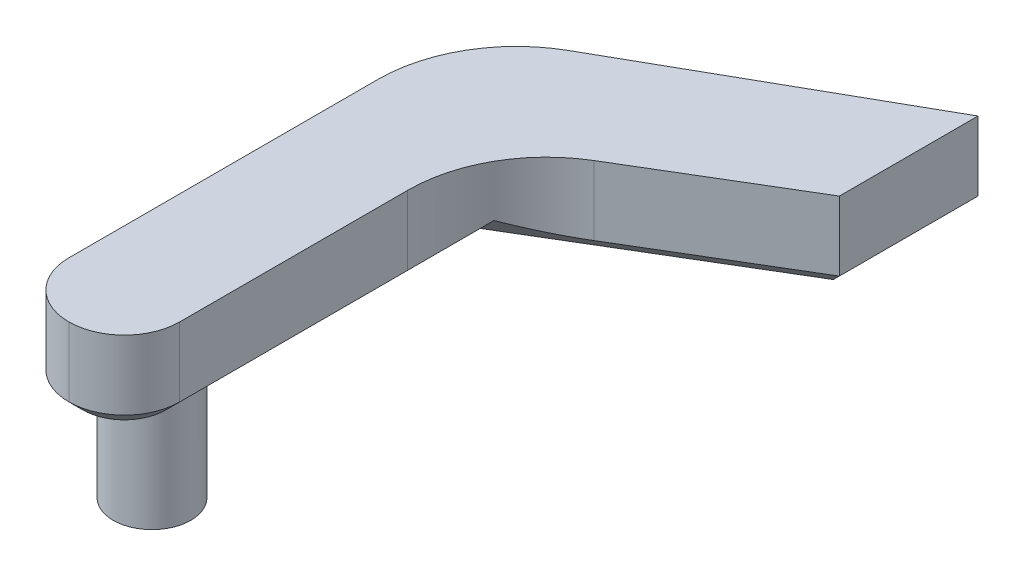
ISO-10303-21;
HEADER;
FILE_DESCRIPTION(('STEP AP214'),'2;1');
FILE_NAME('part.step','',(''),(''),'','','');
FILE_SCHEMA(('AUTOMOTIVE_DESIGN { 1 0 10303 214 1 1 1 1 }'));
ENDSEC;
DATA;
#1=APPLICATION_CONTEXT('core data for automotive mechanical design processes');
#2=APPLICATION_PROTOCOL_DEFINITION('international standard','automotive_design',2000,#1);
#3=PRODUCT_CONTEXT('',#1,'mechanical');
#4=PRODUCT('Part','Part','',(#3));
#5=PRODUCT_RELATED_PRODUCT_CATEGORY('part','',(#4));
#6=PRODUCT_DEFINITION_FORMATION('','',#4);
#7=PRODUCT_DEFINITION_CONTEXT('part definition',#1,'design');
#8=PRODUCT_DEFINITION('design','',#6,#7);
#9=PRODUCT_DEFINITION_SHAPE('','',#8);
#10=(LENGTH_UNIT() NAMED_UNIT(*) SI_UNIT(.MILLI.,.METRE.));
#11=(NAMED_UNIT(*) PLANE_ANGLE_UNIT() SI_UNIT($,.RADIAN.));
#12=(NAMED_UNIT(*) SI_UNIT($,.STERADIAN.) SOLID_ANGLE_UNIT());
#13=UNCERTAINTY_MEASURE_WITH_UNIT(LENGTH_MEASURE(1.E-05),#10,'distance_accuracy_value','');
#14=(GEOMETRIC_REPRESENTATION_CONTEXT(3) GLOBAL_UNCERTAINTY_ASSIGNED_CONTEXT((#13)) GLOBAL_UNIT_ASSIGNED_CONTEXT((#10,
#11,#12)) REPRESENTATION_CONTEXT('',''));
#15=CARTESIAN_POINT('',(0.,0.,0.));
#16=DIRECTION('',(0.,0.,1.));
#17=DIRECTION('',(1.,0.,0.));
#18=AXIS2_PLACEMENT_3D('',#15,#16,#17);
#19=CARTESIAN_POINT('',(-12.,-2.,-9.));
#20=DIRECTION('',(0.,1.,0.));
#21=DIRECTION('',(0.,0.,1.));
#22=AXIS2_PLACEMENT_3D('',#19,#20,#21);
#23=CYLINDRICAL_SURFACE('',#22,2.8);
#24=CARTESIAN_POINT('',(-12.,-2.,-9.));
#25=DIRECTION('',(0.,-1.,0.));
#26=DIRECTION('',(0.,0.,-1.));
#27=AXIS2_PLACEMENT_3D('',#24,#25,#26);
#28=CIRCLE('',#27,2.8);
#29=CARTESIAN_POINT('',(-12.,-2.,-11.8));
#30=VERTEX_POINT('',#29);
#31=EDGE_CURVE('E158',#30,#30,#28,.T.);
#32=ORIENTED_EDGE('',*,*,#31,.F.);
#33=EDGE_LOOP('',(#32));
#34=FACE_BOUND('',#33,.T.);
#35=CARTESIAN_POINT('',(-12.,6.,-9.));
#36=DIRECTION('',(0.,1.,0.));
#37=DIRECTION('',(0.,0.,1.));
#38=AXIS2_PLACEMENT_3D('',#35,#36,#37);
#39=CIRCLE('',#38,2.8);
#40=CARTESIAN_POINT('',(-12.,6.,-6.2));
#41=VERTEX_POINT('',#40);
#42=EDGE_CURVE('E168',#41,#41,#39,.F.);
#43=ORIENTED_EDGE('',*,*,#42,.T.);
#44=EDGE_LOOP('',(#43));
#45=FACE_BOUND('',#44,.T.);
#46=ADVANCED_FACE('F35',(#34,#45),#23,.T.);
#47=CARTESIAN_POINT('',(-12.,-2.,-9.));
#48=DIRECTION('',(0.,-1.,0.));
#49=DIRECTION('',(0.,0.,-1.));
#50=AXIS2_PLACEMENT_3D('',#47,#48,#49);
#51=PLANE('',#50);
#52=ORIENTED_EDGE('',*,*,#31,.T.);
#53=EDGE_LOOP('',(#52));
#54=FACE_BOUND('',#53,.T.);
#55=ADVANCED_FACE('F305',(#54),#51,.T.);
#56=CARTESIAN_POINT('',(7.92980805409412,63.5412283685863,-38.6493429113385));
#57=DIRECTION('',(-1.,0.,0.));
#58=DIRECTION('',(0.,0.,1.));
#59=AXIS2_PLACEMENT_3D('',#56,#57,#58);
#60=PLANE('',#59);
#61=DIRECTION('',(0.,-1.,0.));
#62=VECTOR('',#61,1.);
#63=CARTESIAN_POINT('',(7.92980805409412,63.5412283685863,-38.6493429113385));
#64=LINE('',#63,#62);
#65=CARTESIAN_POINT('',(7.92980805409412,12.,-38.6493429113385));
#66=VERTEX_POINT('',#65);
#67=CARTESIAN_POINT('',(7.92980805409412,7.00000000000001,-38.6493429113385));
#68=VERTEX_POINT('',#67);
#69=EDGE_CURVE('E157',#66,#68,#64,.T.);
#70=ORIENTED_EDGE('',*,*,#69,.T.);
#71=DIRECTION('',(0.,0.,-1.));
#72=VECTOR('',#71,1.);
#73=CARTESIAN_POINT('',(7.92980805409412,6.99999999999999,-38.6493429113385));
#74=LINE('',#73,#72);
#75=CARTESIAN_POINT('',(7.92980805409412,7.00000000000001,-48.6493429113385));
#76=VERTEX_POINT('',#75);
#77=EDGE_CURVE('E156',#68,#76,#74,.T.);
#78=ORIENTED_EDGE('',*,*,#77,.T.);
#79=DIRECTION('',(0.,-1.,0.));
#80=VECTOR('',#79,1.);
#81=CARTESIAN_POINT('',(7.92980805409412,63.5412283685863,-48.6493429113385));
#82=LINE('',#81,#80);
#83=CARTESIAN_POINT('',(7.92980805409412,12.,-48.6493429113385));
#84=VERTEX_POINT('',#83);
#85=EDGE_CURVE('E137',#84,#76,#82,.T.);
#86=ORIENTED_EDGE('',*,*,#85,.F.);
#87=DIRECTION('',(0.,0.,1.));
#88=VECTOR('',#87,1.);
#89=CARTESIAN_POINT('',(7.92980805409412,12.,-38.6493429113385));
#90=LINE('',#89,#88);
#91=EDGE_CURVE('E142',#84,#66,#90,.T.);
#92=ORIENTED_EDGE('',*,*,#91,.T.);
#93=EDGE_LOOP('',(#70,#78,#86,#92));
#94=FACE_BOUND('',#93,.T.);
#95=ADVANCED_FACE('F154',(#94),#60,.F.);
#96=CARTESIAN_POINT('',(-8.,63.5412283685863,-29.1078969431635));
#97=DIRECTION('',(-0.51384465280707,0.,-0.857883251253678));
#98=DIRECTION('',(-0.857883251253678,0.,0.51384465280707));
#99=AXIS2_PLACEMENT_3D('',#96,#97,#98);
#100=PLANE('',#99);
#101=DIRECTION('',(-0.857883251253678,0.,0.51384465280707));
#102=VECTOR('',#101,1.);
#103=CARTESIAN_POINT('',(-8.,12.,-29.1078969431635));
#104=LINE('',#103,#102);
#105=CARTESIAN_POINT('',(-3.1384465280707,12.,-32.0198121160451));
#106=VERTEX_POINT('',#105);
#107=EDGE_CURVE('E148',#66,#106,#104,.T.);
#108=ORIENTED_EDGE('',*,*,#107,.T.);
#109=DIRECTION('',(0.,-1.,0.));
#110=VECTOR('',#109,1.);
#111=CARTESIAN_POINT('',(-3.1384465280707,7.00000000000001,-32.0198121160451));
#112=LINE('',#111,#110);
#113=CARTESIAN_POINT('',(-3.1384465280707,6.99999999999999,-32.0198121160451));
#114=VERTEX_POINT('',#113);
#115=EDGE_CURVE('E238',#106,#114,#112,.T.);
#116=ORIENTED_EDGE('',*,*,#115,.T.);
#117=DIRECTION('',(0.857883251253678,0.,-0.51384465280707));
#118=VECTOR('',#117,1.);
#119=CARTESIAN_POINT('',(-8.,6.99999999999999,-29.1078969431635));
#120=LINE('',#119,#118);
#121=EDGE_CURVE('E201',#114,#68,#120,.T.);
#122=ORIENTED_EDGE('',*,*,#121,.T.);
#123=ORIENTED_EDGE('',*,*,#69,.F.);
#124=EDGE_LOOP('',(#108,#116,#122,#123));
#125=FACE_BOUND('',#124,.T.);
#126=ADVANCED_FACE('F322',(#125),#100,.F.);
#127=CARTESIAN_POINT('',(7.92980805409412,63.5412283685863,-48.6493429113385));
#128=DIRECTION('',(0.492495520100087,0.,0.8703149790055));
#129=DIRECTION('',(0.8703149790055,0.,-0.492495520100087));
#130=AXIS2_PLACEMENT_3D('',#127,#128,#129);
#131=PLANE('',#130);
#132=DIRECTION('',(-0.8703149790055,0.,0.492495520100087));
#133=VECTOR('',#132,1.);
#134=CARTESIAN_POINT('',(7.92980805409412,6.99999999999999,-48.6493429113385));
#135=LINE('',#134,#133);
#136=CARTESIAN_POINT('',(-10.9249552010009,6.99999999999999,-37.9797730892806));
#137=VERTEX_POINT('',#136);
#138=EDGE_CURVE('E203',#76,#137,#135,.T.);
#139=ORIENTED_EDGE('',*,*,#138,.T.);
#140=DIRECTION('',(0.,-1.,0.));
#141=VECTOR('',#140,1.);
#142=CARTESIAN_POINT('',(-10.9249552010009,63.5412283685863,-37.9797730892806));
#143=LINE('',#142,#141);
#144=CARTESIAN_POINT('',(-10.9249552010009,12.,-37.9797730892806));
#145=VERTEX_POINT('',#144);
#146=EDGE_CURVE('E139',#137,#145,#143,.F.);
#147=ORIENTED_EDGE('',*,*,#146,.T.);
#148=DIRECTION('',(0.8703149790055,0.,-0.492495520100087));
#149=VECTOR('',#148,1.);
#150=CARTESIAN_POINT('',(7.92980805409412,12.,-48.6493429113385));
#151=LINE('',#150,#149);
#152=EDGE_CURVE('E132',#145,#84,#151,.T.);
#153=ORIENTED_EDGE('',*,*,#152,.T.);
#154=ORIENTED_EDGE('',*,*,#85,.T.);
#155=EDGE_LOOP('',(#139,#147,#153,#154));
#156=FACE_BOUND('',#155,.T.);
#157=ADVANCED_FACE('F135',(#156),#131,.F.);
#158=CARTESIAN_POINT('',(0.,12.,0.));
#159=DIRECTION('',(0.,-1.,0.));
#160=DIRECTION('',(0.,0.,-1.));
#161=AXIS2_PLACEMENT_3D('',#158,#159,#160);
#162=PLANE('',#161);
#163=ORIENTED_EDGE('',*,*,#152,.F.);
#164=CARTESIAN_POINT('',(-6.00000000000001,12.,-29.2766232992256));
#165=DIRECTION('',(0.,-1.,0.));
#166=DIRECTION('',(0.,0.,-1.));
#167=AXIS2_PLACEMENT_3D('',#164,#165,#166);
#168=CIRCLE('',#167,10.);
#169=CARTESIAN_POINT('',(-16.,12.,-29.2766232992256));
#170=VERTEX_POINT('',#169);
#171=EDGE_CURVE('E236',#145,#170,#168,.F.);
#172=ORIENTED_EDGE('',*,*,#171,.T.);
#173=DIRECTION('',(0.,0.,-1.));
#174=VECTOR('',#173,1.);
#175=CARTESIAN_POINT('',(-16.,12.,-3.));
#176=LINE('',#175,#174);
#177=CARTESIAN_POINT('',(-16.,12.,-6.99999999999999));
#178=VERTEX_POINT('',#177);
#179=EDGE_CURVE('E143',#178,#170,#176,.T.);
#180=ORIENTED_EDGE('',*,*,#179,.F.);
#181=CARTESIAN_POINT('',(-12.,12.,-6.99999999999999));
#182=DIRECTION('',(0.,-1.,0.));
#183=DIRECTION('',(0.,0.,-1.));
#184=AXIS2_PLACEMENT_3D('',#181,#182,#183);
#185=CIRCLE('',#184,4.);
#186=CARTESIAN_POINT('',(-12.,12.,-3.));
#187=VERTEX_POINT('',#186);
#188=EDGE_CURVE('E174',#178,#187,#185,.F.);
#189=ORIENTED_EDGE('',*,*,#188,.T.);
#190=CARTESIAN_POINT('',(-12.,12.,-7.));
#191=DIRECTION('',(0.,-1.,0.));
#192=DIRECTION('',(0.,0.,-1.));
#193=AXIS2_PLACEMENT_3D('',#190,#191,#192);
#194=CIRCLE('',#193,4.);
#195=CARTESIAN_POINT('',(-8.,12.,-7.));
#196=VERTEX_POINT('',#195);
#197=EDGE_CURVE('E176',#187,#196,#194,.F.);
#198=ORIENTED_EDGE('',*,*,#197,.T.);
#199=DIRECTION('',(0.,0.,1.));
#200=VECTOR('',#199,1.);
#201=CARTESIAN_POINT('',(-8.,12.,-3.));
#202=LINE('',#201,#200);
#203=CARTESIAN_POINT('',(-8.,12.,-23.4409796035083));
#204=VERTEX_POINT('',#203);
#205=EDGE_CURVE('E165',#204,#196,#202,.T.);
#206=ORIENTED_EDGE('',*,*,#205,.F.);
#207=CARTESIAN_POINT('',(2.,12.,-23.4409796035083));
#208=DIRECTION('',(0.,-1.,0.));
#209=DIRECTION('',(0.,0.,-1.));
#210=AXIS2_PLACEMENT_3D('',#207,#208,#209);
#211=CIRCLE('',#210,10.);
#212=EDGE_CURVE('E11',#204,#106,#211,.T.);
#213=ORIENTED_EDGE('',*,*,#212,.T.);
#214=ORIENTED_EDGE('',*,*,#107,.F.);
#215=ORIENTED_EDGE('',*,*,#91,.F.);
#216=EDGE_LOOP('',(#163,#172,#180,#189,#198,#206,#213,#214,#215));
#217=FACE_BOUND('',#216,.T.);
#218=ADVANCED_FACE('F146',(#217),#162,.F.);
#219=CARTESIAN_POINT('',(0.,6.,0.));
#220=DIRECTION('',(0.,1.,0.));
#221=DIRECTION('',(0.,0.,1.));
#222=AXIS2_PLACEMENT_3D('',#219,#220,#221);
#223=PLANE('',#222);
#224=DIRECTION('',(0.,0.,-1.));
#225=VECTOR('',#224,1.);
#226=CARTESIAN_POINT('',(-15.,6.,0.));
#227=LINE('',#226,#225);
#228=CARTESIAN_POINT('',(-15.,6.,-6.99999999999999));
#229=VERTEX_POINT('',#228);
#230=CARTESIAN_POINT('',(-15.,6.,-33.6355222427663));
#231=VERTEX_POINT('',#230);
#232=EDGE_CURVE('E191',#229,#231,#227,.T.);
#233=ORIENTED_EDGE('',*,*,#232,.T.);
#234=CARTESIAN_POINT('',(-6.00000000000001,6.,-29.2766232992256));
#235=DIRECTION('',(0.,1.,0.));
#236=DIRECTION('',(0.,0.,1.));
#237=AXIS2_PLACEMENT_3D('',#234,#235,#236);
#238=CIRCLE('',#237,10.);
#239=CARTESIAN_POINT('',(-14.2260747234355,6.,-34.9627199080124));
#240=VERTEX_POINT('',#239);
#241=EDGE_CURVE('E231',#231,#240,#238,.F.);
#242=ORIENTED_EDGE('',*,*,#241,.T.);
#243=DIRECTION('',(0.870314979005501,0.,-0.492495520100087));
#244=VECTOR('',#243,1.);
#245=CARTESIAN_POINT('',(-18.4364993250522,6.,-32.5801167079791));
#246=LINE('',#245,#244);
#247=CARTESIAN_POINT('',(6.92980805409412,6.,-46.934451686778));
#248=VERTEX_POINT('',#247);
#249=EDGE_CURVE('E194',#240,#248,#246,.T.);
#250=ORIENTED_EDGE('',*,*,#249,.T.);
#251=DIRECTION('',(0.,0.,1.));
#252=VECTOR('',#251,1.);
#253=CARTESIAN_POINT('',(6.92980805409412,6.,0.));
#254=LINE('',#253,#252);
#255=CARTESIAN_POINT('',(6.92980805409412,6.,-39.216034645304));
#256=VERTEX_POINT('',#255);
#257=EDGE_CURVE('E198',#248,#256,#254,.T.);
#258=ORIENTED_EDGE('',*,*,#257,.T.);
#259=DIRECTION('',(-0.857883251253678,0.,0.51384465280707));
#260=VECTOR('',#259,1.);
#261=CARTESIAN_POINT('',(-15.4574411833755,6.,-25.8067877636077));
#262=LINE('',#261,#260);
#263=CARTESIAN_POINT('',(-9.00000000000001,6.,-29.6745886771291));
#264=VERTEX_POINT('',#263);
#265=EDGE_CURVE('E196',#256,#264,#262,.T.);
#266=ORIENTED_EDGE('',*,*,#265,.T.);
#267=DIRECTION('',(0.,0.,1.));
#268=VECTOR('',#267,1.);
#269=CARTESIAN_POINT('',(-9.00000000000001,6.,0.));
#270=LINE('',#269,#268);
#271=CARTESIAN_POINT('',(-9.00000000000001,6.,-7.));
#272=VERTEX_POINT('',#271);
#273=EDGE_CURVE('E185',#264,#272,#270,.T.);
#274=ORIENTED_EDGE('',*,*,#273,.T.);
#275=CARTESIAN_POINT('',(-12.,6.,-7.));
#276=DIRECTION('',(0.,1.,0.));
#277=DIRECTION('',(0.,0.,1.));
#278=AXIS2_PLACEMENT_3D('',#275,#276,#277);
#279=CIRCLE('',#278,3.);
#280=CARTESIAN_POINT('',(-12.,6.,-3.99999999999999));
#281=VERTEX_POINT('',#280);
#282=EDGE_CURVE('E187',#272,#281,#279,.F.);
#283=ORIENTED_EDGE('',*,*,#282,.T.);
#284=CARTESIAN_POINT('',(-12.,6.,-6.99999999999999));
#285=DIRECTION('',(0.,1.,0.));
#286=DIRECTION('',(0.,0.,1.));
#287=AXIS2_PLACEMENT_3D('',#284,#285,#286);
#288=CIRCLE('',#287,3.);
#289=EDGE_CURVE('E189',#281,#229,#288,.F.);
#290=ORIENTED_EDGE('',*,*,#289,.T.);
#291=EDGE_LOOP('',(#233,#242,#250,#258,#266,#274,#283,#290));
#292=FACE_BOUND('',#291,.T.);
#293=ORIENTED_EDGE('',*,*,#42,.F.);
#294=EDGE_LOOP('',(#293));
#295=FACE_BOUND('',#294,.T.);
#296=ADVANCED_FACE('F276',(#292,#295),#223,.F.);
#297=CARTESIAN_POINT('',(-16.,63.5412283685863,-3.));
#298=DIRECTION('',(1.,0.,0.));
#299=DIRECTION('',(0.,0.,-1.));
#300=AXIS2_PLACEMENT_3D('',#297,#298,#299);
#301=PLANE('',#300);
#302=ORIENTED_EDGE('',*,*,#179,.T.);
#303=DIRECTION('',(0.,-1.,0.));
#304=VECTOR('',#303,1.);
#305=CARTESIAN_POINT('',(-16.,63.5412283685863,-29.2766232992256));
#306=LINE('',#305,#304);
#307=CARTESIAN_POINT('',(-16.,6.99999999999999,-29.2766232992256));
#308=VERTEX_POINT('',#307);
#309=EDGE_CURVE('E213',#170,#308,#306,.T.);
#310=ORIENTED_EDGE('',*,*,#309,.T.);
#311=DIRECTION('',(0.,0.,1.));
#312=VECTOR('',#311,1.);
#313=CARTESIAN_POINT('',(-16.,6.99999999999999,-3.));
#314=LINE('',#313,#312);
#315=CARTESIAN_POINT('',(-16.,6.99999999999999,-6.99999999999999));
#316=VERTEX_POINT('',#315);
#317=EDGE_CURVE('E205',#308,#316,#314,.T.);
#318=ORIENTED_EDGE('',*,*,#317,.T.);
#319=DIRECTION('',(0.,-1.,0.));
#320=VECTOR('',#319,1.);
#321=CARTESIAN_POINT('',(-16.,63.5412283685863,-6.99999999999999));
#322=LINE('',#321,#320);
#323=EDGE_CURVE('E179',#316,#178,#322,.F.);
#324=ORIENTED_EDGE('',*,*,#323,.T.);
#325=EDGE_LOOP('',(#302,#310,#318,#324));
#326=FACE_BOUND('',#325,.T.);
#327=ADVANCED_FACE('F264',(#326),#301,.F.);
#328=CARTESIAN_POINT('',(-8.,63.5412283685863,-3.));
#329=DIRECTION('',(-1.,0.,0.));
#330=DIRECTION('',(0.,0.,1.));
#331=AXIS2_PLACEMENT_3D('',#328,#329,#330);
#332=PLANE('',#331);
#333=DIRECTION('',(0.,0.,-1.));
#334=VECTOR('',#333,1.);
#335=CARTESIAN_POINT('',(-8.,6.99999999999999,-3.));
#336=LINE('',#335,#334);
#337=CARTESIAN_POINT('',(-8.,6.99999999999999,-7.));
#338=VERTEX_POINT('',#337);
#339=CARTESIAN_POINT('',(-8.,6.99999999999999,-23.4409796035083));
#340=VERTEX_POINT('',#339);
#341=EDGE_CURVE('E211',#338,#340,#336,.T.);
#342=ORIENTED_EDGE('',*,*,#341,.T.);
#343=DIRECTION('',(0.,-1.,0.));
#344=VECTOR('',#343,1.);
#345=CARTESIAN_POINT('',(-8.,12.,-23.4409796035083));
#346=LINE('',#345,#344);
#347=EDGE_CURVE('E241',#340,#204,#346,.F.);
#348=ORIENTED_EDGE('',*,*,#347,.T.);
#349=ORIENTED_EDGE('',*,*,#205,.T.);
#350=DIRECTION('',(0.,-1.,0.));
#351=VECTOR('',#350,1.);
#352=CARTESIAN_POINT('',(-8.,63.5412283685863,-7.));
#353=LINE('',#352,#351);
#354=EDGE_CURVE('E171',#196,#338,#353,.T.);
#355=ORIENTED_EDGE('',*,*,#354,.T.);
#356=EDGE_LOOP('',(#342,#348,#349,#355));
#357=FACE_BOUND('',#356,.T.);
#358=ADVANCED_FACE('F255',(#357),#332,.F.);
#359=CARTESIAN_POINT('',(-12.,63.5412283685863,-6.99999999999999));
#360=DIRECTION('',(0.,-1.,0.));
#361=DIRECTION('',(0.,0.,-1.));
#362=AXIS2_PLACEMENT_3D('',#359,#360,#361);
#363=CYLINDRICAL_SURFACE('',#362,4.);
#364=ORIENTED_EDGE('',*,*,#323,.F.);
#365=CARTESIAN_POINT('',(-12.,6.99999999999999,-6.99999999999999));
#366=DIRECTION('',(0.,1.,0.));
#367=DIRECTION('',(0.,0.,1.));
#368=AXIS2_PLACEMENT_3D('',#365,#366,#367);
#369=CIRCLE('',#368,4.);
#370=CARTESIAN_POINT('',(-12.,6.99999999999999,-3.));
#371=VERTEX_POINT('',#370);
#372=EDGE_CURVE('E207',#316,#371,#369,.T.);
#373=ORIENTED_EDGE('',*,*,#372,.T.);
#374=DIRECTION('',(0.,-1.,0.));
#375=VECTOR('',#374,1.);
#376=CARTESIAN_POINT('',(-12.,63.5412283685863,-3.));
#377=LINE('',#376,#375);
#378=EDGE_CURVE('E162',#187,#371,#377,.T.);
#379=ORIENTED_EDGE('',*,*,#378,.F.);
#380=ORIENTED_EDGE('',*,*,#188,.F.);
#381=EDGE_LOOP('',(#364,#373,#379,#380));
#382=FACE_BOUND('',#381,.T.);
#383=ADVANCED_FACE('F288',(#382),#363,.T.);
#384=CARTESIAN_POINT('',(-12.,63.5412283685863,-7.));
#385=DIRECTION('',(0.,-1.,0.));
#386=DIRECTION('',(0.,0.,-1.));
#387=AXIS2_PLACEMENT_3D('',#384,#385,#386);
#388=CYLINDRICAL_SURFACE('',#387,4.);
#389=ORIENTED_EDGE('',*,*,#378,.T.);
#390=CARTESIAN_POINT('',(-12.,6.99999999999999,-7.));
#391=DIRECTION('',(0.,1.,0.));
#392=DIRECTION('',(0.,0.,1.));
#393=AXIS2_PLACEMENT_3D('',#390,#391,#392);
#394=CIRCLE('',#393,4.);
#395=EDGE_CURVE('E209',#371,#338,#394,.T.);
#396=ORIENTED_EDGE('',*,*,#395,.T.);
#397=ORIENTED_EDGE('',*,*,#354,.F.);
#398=ORIENTED_EDGE('',*,*,#197,.F.);
#399=EDGE_LOOP('',(#389,#396,#397,#398));
#400=FACE_BOUND('',#399,.T.);
#401=ADVANCED_FACE('F291',(#400),#388,.T.);
#402=CARTESIAN_POINT('',(-12.,6.,-7.));
#403=DIRECTION('',(0.,1.,0.));
#404=DIRECTION('',(0.,0.,1.));
#405=AXIS2_PLACEMENT_3D('',#402,#403,#404);
#406=CONICAL_SURFACE('',#405,3.,0.785398163397452);
#407=DIRECTION('',(-0.70710678118655,-0.707106781186545,0.));
#408=VECTOR('',#407,1.);
#409=CARTESIAN_POINT('',(-8.,6.99999999999999,-7.));
#410=LINE('',#409,#408);
#411=EDGE_CURVE('E222',#338,#272,#410,.T.);
#412=ORIENTED_EDGE('',*,*,#411,.F.);
#413=ORIENTED_EDGE('',*,*,#395,.F.);
#414=DIRECTION('',(0.,0.707106781186545,0.70710678118655));
#415=VECTOR('',#414,1.);
#416=CARTESIAN_POINT('',(-12.,6.,-3.99999999999999));
#417=LINE('',#416,#415);
#418=EDGE_CURVE('E183',#281,#371,#417,.T.);
#419=ORIENTED_EDGE('',*,*,#418,.F.);
#420=ORIENTED_EDGE('',*,*,#282,.F.);
#421=EDGE_LOOP('',(#412,#413,#419,#420));
#422=FACE_BOUND('',#421,.T.);
#423=ADVANCED_FACE('F294',(#422),#406,.T.);
#424=CARTESIAN_POINT('',(-12.,6.,-6.99999999999999));
#425=DIRECTION('',(0.,1.,0.));
#426=DIRECTION('',(0.,0.,1.));
#427=AXIS2_PLACEMENT_3D('',#424,#425,#426);
#428=CONICAL_SURFACE('',#427,3.,0.785398163397452);
#429=ORIENTED_EDGE('',*,*,#418,.T.);
#430=ORIENTED_EDGE('',*,*,#372,.F.);
#431=DIRECTION('',(-0.70710678118655,0.707106781186545,0.));
#432=VECTOR('',#431,1.);
#433=CARTESIAN_POINT('',(-15.,6.,-6.99999999999999));
#434=LINE('',#433,#432);
#435=EDGE_CURVE('E219',#229,#316,#434,.T.);
#436=ORIENTED_EDGE('',*,*,#435,.F.);
#437=ORIENTED_EDGE('',*,*,#289,.F.);
#438=EDGE_LOOP('',(#429,#430,#436,#437));
#439=FACE_BOUND('',#438,.T.);
#440=ADVANCED_FACE('F285',(#439),#428,.T.);
#441=CARTESIAN_POINT('',(-8.,6.99999999999999,-3.));
#442=DIRECTION('',(-0.707106781186544,0.707106781186551,0.));
#443=DIRECTION('',(0.,0.,-1.));
#444=AXIS2_PLACEMENT_3D('',#441,#442,#443);
#445=PLANE('',#444);
#446=ORIENTED_EDGE('',*,*,#411,.T.);
#447=ORIENTED_EDGE('',*,*,#273,.F.);
#448=DIRECTION('',(0.656370988235958,0.656370988235952,0.371960013448101));
#449=VECTOR('',#448,1.);
#450=CARTESIAN_POINT('',(-8.,6.99999999999999,-29.1078969431635));
#451=LINE('',#450,#449);
#452=CARTESIAN_POINT('',(-6.70012831171779,8.29987168828219,-28.3712704021982));
#453=VERTEX_POINT('',#452);
#454=EDGE_CURVE('E50',#453,#264,#451,.F.);
#455=ORIENTED_EDGE('',*,*,#454,.F.);
#456=CARTESIAN_POINT('',(2.,16.9999999999999,-23.4409796035083));
#457=DIRECTION('',(-0.707106781186544,0.707106781186551,0.));
#458=DIRECTION('',(0.707106781186551,0.707106781186544,0.));
#459=AXIS2_PLACEMENT_3D('',#456,#457,#458);
#460=ELLIPSE('',#459,14.1421356237309,10.);
#461=EDGE_CURVE('E43',#453,#340,#460,.T.);
#462=ORIENTED_EDGE('',*,*,#461,.T.);
#463=ORIENTED_EDGE('',*,*,#341,.F.);
#464=EDGE_LOOP('',(#446,#447,#455,#462,#463));
#465=FACE_BOUND('',#464,.T.);
#466=ADVANCED_FACE('F295',(#465),#445,.F.);
#467=CARTESIAN_POINT('',(-16.,6.99999999999999,-3.));
#468=DIRECTION('',(0.707106781186545,0.70710678118655,0.));
#469=DIRECTION('',(0.,0.,1.));
#470=AXIS2_PLACEMENT_3D('',#467,#468,#469);
#471=PLANE('',#470);
#472=ORIENTED_EDGE('',*,*,#317,.F.);
#473=CARTESIAN_POINT('',(-6.00000000000001,-2.99999999999992,-29.2766232992256));
#474=DIRECTION('',(0.707106781186545,0.70710678118655,0.));
#475=DIRECTION('',(0.70710678118655,-0.707106781186545,0.));
#476=AXIS2_PLACEMENT_3D('',#473,#474,#475);
#477=ELLIPSE('',#476,14.1421356237309,10.);
#478=EDGE_CURVE('E229',#308,#231,#477,.F.);
#479=ORIENTED_EDGE('',*,*,#478,.T.);
#480=ORIENTED_EDGE('',*,*,#232,.F.);
#481=ORIENTED_EDGE('',*,*,#435,.T.);
#482=EDGE_LOOP('',(#472,#479,#480,#481));
#483=FACE_BOUND('',#482,.T.);
#484=ADVANCED_FACE('F274',(#483),#471,.F.);
#485=CARTESIAN_POINT('',(-8.,6.99999999999999,-29.1078969431635));
#486=DIRECTION('',(-0.363343038476325,0.707106781186551,-0.606615064427836));
#487=DIRECTION('',(0.857883251253678,0.,-0.51384465280707));
#488=AXIS2_PLACEMENT_3D('',#485,#486,#487);
#489=PLANE('',#488);
#490=ORIENTED_EDGE('',*,*,#454,.T.);
#491=ORIENTED_EDGE('',*,*,#265,.F.);
#492=DIRECTION('',(0.656370988235958,0.656370988235952,0.371960013448101));
#493=VECTOR('',#492,1.);
#494=CARTESIAN_POINT('',(3.39636687268943,2.46655881859534,-41.2184065552595));
#495=LINE('',#494,#493);
#496=EDGE_CURVE('E216',#68,#256,#495,.F.);
#497=ORIENTED_EDGE('',*,*,#496,.F.);
#498=ORIENTED_EDGE('',*,*,#121,.F.);
#499=CARTESIAN_POINT('',(2.,16.9999999999999,-23.4409796035083));
#500=DIRECTION('',(-0.363343038476325,0.707106781186551,-0.606615064427836));
#501=DIRECTION('',(0.363343038476328,0.707106781186544,0.606615064427841));
#502=AXIS2_PLACEMENT_3D('',#499,#500,#501);
#503=ELLIPSE('',#502,14.1421356237309,10.);
#504=EDGE_CURVE('E243',#114,#453,#503,.T.);
#505=ORIENTED_EDGE('',*,*,#504,.T.);
#506=EDGE_LOOP('',(#490,#491,#497,#498,#505));
#507=FACE_BOUND('',#506,.T.);
#508=ADVANCED_FACE('F246',(#507),#489,.F.);
#509=CARTESIAN_POINT('',(7.92980805409412,6.99999999999999,-48.6493429113385));
#510=DIRECTION('',(0.348246921966766,0.707106781186549,0.615405623423016));
#511=DIRECTION('',(-0.8703149790055,0.,0.492495520100087));
#512=AXIS2_PLACEMENT_3D('',#509,#510,#511);
#513=PLANE('',#512);
#514=ORIENTED_EDGE('',*,*,#249,.F.);
#515=CARTESIAN_POINT('',(-6.00000000000001,-2.99999999999996,-29.2766232992256));
#516=DIRECTION('',(0.348246921966766,0.707106781186549,0.615405623423016));
#517=DIRECTION('',(0.348246921966768,-0.707106781186546,0.615405623423019));
#518=AXIS2_PLACEMENT_3D('',#515,#516,#517);
#519=ELLIPSE('',#518,14.1421356237309,10.);
#520=EDGE_CURVE('E233',#240,#137,#519,.F.);
#521=ORIENTED_EDGE('',*,*,#520,.T.);
#522=ORIENTED_EDGE('',*,*,#138,.F.);
#523=DIRECTION('',(-0.449882480808006,-0.449882480808002,0.771499518421154));
#524=VECTOR('',#523,1.);
#525=CARTESIAN_POINT('',(7.92980805409412,6.99999999999999,-48.6493429113385));
#526=LINE('',#525,#524);
#527=EDGE_CURVE('E214',#248,#76,#526,.F.);
#528=ORIENTED_EDGE('',*,*,#527,.F.);
#529=EDGE_LOOP('',(#514,#521,#522,#528));
#530=FACE_BOUND('',#529,.T.);
#531=ADVANCED_FACE('F338',(#530),#513,.F.);
#532=CARTESIAN_POINT('',(7.92980805409412,6.99999999999999,-38.6493429113385));
#533=DIRECTION('',(-0.707106781186544,0.707106781186551,0.));
#534=DIRECTION('',(0.,0.,-1.));
#535=AXIS2_PLACEMENT_3D('',#532,#533,#534);
#536=PLANE('',#535);
#537=ORIENTED_EDGE('',*,*,#496,.T.);
#538=ORIENTED_EDGE('',*,*,#257,.F.);
#539=ORIENTED_EDGE('',*,*,#527,.T.);
#540=ORIENTED_EDGE('',*,*,#77,.F.);
#541=EDGE_LOOP('',(#537,#538,#539,#540));
#542=FACE_BOUND('',#541,.T.);
#543=ADVANCED_FACE('F335',(#542),#536,.F.);
#544=CARTESIAN_POINT('',(-6.00000000000001,63.5412283685863,-29.2766232992256));
#545=DIRECTION('',(0.,-1.,0.));
#546=DIRECTION('',(0.,0.,-1.));
#547=AXIS2_PLACEMENT_3D('',#544,#545,#546);
#548=CYLINDRICAL_SURFACE('',#547,10.);
#549=ORIENTED_EDGE('',*,*,#171,.F.);
#550=ORIENTED_EDGE('',*,*,#146,.F.);
#551=ORIENTED_EDGE('',*,*,#520,.F.);
#552=ORIENTED_EDGE('',*,*,#241,.F.);
#553=ORIENTED_EDGE('',*,*,#478,.F.);
#554=ORIENTED_EDGE('',*,*,#309,.F.);
#555=EDGE_LOOP('',(#549,#550,#551,#552,#553,#554));
#556=FACE_BOUND('',#555,.T.);
#557=ADVANCED_FACE('F269',(#556),#548,.T.);
#558=CARTESIAN_POINT('',(2.,63.5412283685863,-23.4409796035083));
#559=DIRECTION('',(0.,1.,0.));
#560=DIRECTION('',(0.,0.,1.));
#561=AXIS2_PLACEMENT_3D('',#558,#559,#560);
#562=CYLINDRICAL_SURFACE('',#561,10.);
#563=ORIENTED_EDGE('',*,*,#212,.F.);
#564=ORIENTED_EDGE('',*,*,#347,.F.);
#565=ORIENTED_EDGE('',*,*,#461,.F.);
#566=ORIENTED_EDGE('',*,*,#504,.F.);
#567=ORIENTED_EDGE('',*,*,#115,.F.);
#568=EDGE_LOOP('',(#563,#564,#565,#566,#567));
#569=FACE_BOUND('',#568,.T.);
#570=ADVANCED_FACE('F37',(#569),#562,.F.);
#571=CLOSED_SHELL('',(#46,#55,#95,#126,#157,#218,#296,#327,#358,#383,#401,#423,#440,#466,#484,
#508,#531,#543,#557,#570));
#572=MANIFOLD_SOLID_BREP('B2',#571);
#573=ADVANCED_BREP_SHAPE_REPRESENTATION('',(#18,#572),#14);
#574=SHAPE_DEFINITION_REPRESENTATION(#9,#573);
ENDSEC;
END-ISO-10303-21;
